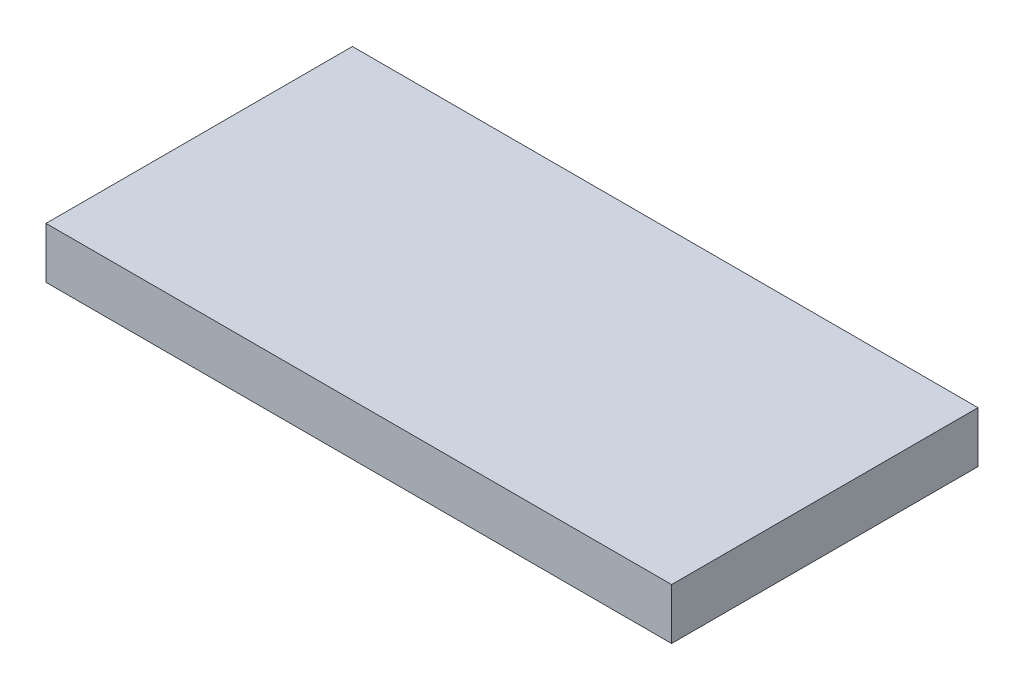
ISO-10303-21;
HEADER;
FILE_DESCRIPTION(('STEP AP214'),'2;1');
FILE_NAME('part.step','',(''),(''),'','','');
FILE_SCHEMA(('AUTOMOTIVE_DESIGN { 1 0 10303 214 1 1 1 1 }'));
ENDSEC;
DATA;
#1=APPLICATION_CONTEXT('core data for automotive mechanical design processes');
#2=APPLICATION_PROTOCOL_DEFINITION('international standard','automotive_design',2000,#1);
#3=PRODUCT_CONTEXT('',#1,'mechanical');
#4=PRODUCT('Part','Part','',(#3));
#5=PRODUCT_RELATED_PRODUCT_CATEGORY('part','',(#4));
#6=PRODUCT_DEFINITION_FORMATION('','',#4);
#7=PRODUCT_DEFINITION_CONTEXT('part definition',#1,'design');
#8=PRODUCT_DEFINITION('design','',#6,#7);
#9=PRODUCT_DEFINITION_SHAPE('','',#8);
#10=(LENGTH_UNIT() NAMED_UNIT(*) SI_UNIT(.MILLI.,.METRE.));
#11=(NAMED_UNIT(*) PLANE_ANGLE_UNIT() SI_UNIT($,.RADIAN.));
#12=(NAMED_UNIT(*) SI_UNIT($,.STERADIAN.) SOLID_ANGLE_UNIT());
#13=UNCERTAINTY_MEASURE_WITH_UNIT(LENGTH_MEASURE(1.E-05),#10,'distance_accuracy_value','');
#14=(GEOMETRIC_REPRESENTATION_CONTEXT(3) GLOBAL_UNCERTAINTY_ASSIGNED_CONTEXT((#13)) GLOBAL_UNIT_ASSIGNED_CONTEXT((#10,
#11,#12)) REPRESENTATION_CONTEXT('',''));
#15=CARTESIAN_POINT('',(0.,0.,0.));
#16=DIRECTION('',(0.,0.,1.));
#17=DIRECTION('',(1.,0.,0.));
#18=AXIS2_PLACEMENT_3D('',#15,#16,#17);
#19=CARTESIAN_POINT('',(49.,8.,24.));
#20=DIRECTION('',(-1.,0.,0.));
#21=DIRECTION('',(0.,0.,1.));
#22=AXIS2_PLACEMENT_3D('',#19,#20,#21);
#23=PLANE('',#22);
#24=DIRECTION('',(0.,0.,-1.));
#25=VECTOR('',#24,1.);
#26=CARTESIAN_POINT('',(49.,0.,24.));
#27=LINE('',#26,#25);
#28=CARTESIAN_POINT('',(49.,0.,24.));
#29=VERTEX_POINT('',#28);
#30=CARTESIAN_POINT('',(49.,0.,-24.));
#31=VERTEX_POINT('',#30);
#32=EDGE_CURVE('E96',#29,#31,#27,.T.);
#33=ORIENTED_EDGE('',*,*,#32,.T.);
#34=DIRECTION('',(0.,-1.,0.));
#35=VECTOR('',#34,1.);
#36=CARTESIAN_POINT('',(49.,8.,-24.));
#37=LINE('',#36,#35);
#38=CARTESIAN_POINT('',(49.,8.,-24.));
#39=VERTEX_POINT('',#38);
#40=EDGE_CURVE('E11',#39,#31,#37,.T.);
#41=ORIENTED_EDGE('',*,*,#40,.F.);
#42=DIRECTION('',(0.,0.,-1.));
#43=VECTOR('',#42,1.);
#44=CARTESIAN_POINT('',(49.,8.,24.));
#45=LINE('',#44,#43);
#46=CARTESIAN_POINT('',(49.,8.,24.));
#47=VERTEX_POINT('',#46);
#48=EDGE_CURVE('E84',#47,#39,#45,.T.);
#49=ORIENTED_EDGE('',*,*,#48,.F.);
#50=DIRECTION('',(0.,-1.,0.));
#51=VECTOR('',#50,1.);
#52=CARTESIAN_POINT('',(49.,8.,24.));
#53=LINE('',#52,#51);
#54=EDGE_CURVE('E92',#47,#29,#53,.T.);
#55=ORIENTED_EDGE('',*,*,#54,.T.);
#56=EDGE_LOOP('',(#33,#41,#49,#55));
#57=FACE_BOUND('',#56,.T.);
#58=ADVANCED_FACE('F33',(#57),#23,.F.);
#59=CARTESIAN_POINT('',(-49.,8.,-24.));
#60=DIRECTION('',(0.,0.,1.));
#61=DIRECTION('',(1.,0.,0.));
#62=AXIS2_PLACEMENT_3D('',#59,#60,#61);
#63=PLANE('',#62);
#64=DIRECTION('',(-1.,0.,0.));
#65=VECTOR('',#64,1.);
#66=CARTESIAN_POINT('',(-49.,0.,-24.));
#67=LINE('',#66,#65);
#68=CARTESIAN_POINT('',(-49.,0.,-24.));
#69=VERTEX_POINT('',#68);
#70=EDGE_CURVE('E88',#31,#69,#67,.T.);
#71=ORIENTED_EDGE('',*,*,#70,.T.);
#72=DIRECTION('',(0.,-1.,0.));
#73=VECTOR('',#72,1.);
#74=CARTESIAN_POINT('',(-49.,8.,-24.));
#75=LINE('',#74,#73);
#76=CARTESIAN_POINT('',(-49.,8.,-24.));
#77=VERTEX_POINT('',#76);
#78=EDGE_CURVE('E41',#77,#69,#75,.T.);
#79=ORIENTED_EDGE('',*,*,#78,.F.);
#80=DIRECTION('',(-1.,0.,0.));
#81=VECTOR('',#80,1.);
#82=CARTESIAN_POINT('',(-49.,8.,-24.));
#83=LINE('',#82,#81);
#84=EDGE_CURVE('E79',#39,#77,#83,.T.);
#85=ORIENTED_EDGE('',*,*,#84,.F.);
#86=ORIENTED_EDGE('',*,*,#40,.T.);
#87=EDGE_LOOP('',(#71,#79,#85,#86));
#88=FACE_BOUND('',#87,.T.);
#89=ADVANCED_FACE('F87',(#88),#63,.F.);
#90=CARTESIAN_POINT('',(-49.,8.,24.));
#91=DIRECTION('',(1.,0.,0.));
#92=DIRECTION('',(0.,0.,-1.));
#93=AXIS2_PLACEMENT_3D('',#90,#91,#92);
#94=PLANE('',#93);
#95=DIRECTION('',(0.,0.,1.));
#96=VECTOR('',#95,1.);
#97=CARTESIAN_POINT('',(-49.,0.,24.));
#98=LINE('',#97,#96);
#99=CARTESIAN_POINT('',(-49.,0.,24.));
#100=VERTEX_POINT('',#99);
#101=EDGE_CURVE('E66',#69,#100,#98,.T.);
#102=ORIENTED_EDGE('',*,*,#101,.T.);
#103=DIRECTION('',(0.,-1.,0.));
#104=VECTOR('',#103,1.);
#105=CARTESIAN_POINT('',(-49.,8.,24.));
#106=LINE('',#105,#104);
#107=CARTESIAN_POINT('',(-49.,8.,24.));
#108=VERTEX_POINT('',#107);
#109=EDGE_CURVE('E89',#108,#100,#106,.T.);
#110=ORIENTED_EDGE('',*,*,#109,.F.);
#111=DIRECTION('',(0.,0.,1.));
#112=VECTOR('',#111,1.);
#113=CARTESIAN_POINT('',(-49.,8.,24.));
#114=LINE('',#113,#112);
#115=EDGE_CURVE('E82',#77,#108,#114,.T.);
#116=ORIENTED_EDGE('',*,*,#115,.F.);
#117=ORIENTED_EDGE('',*,*,#78,.T.);
#118=EDGE_LOOP('',(#102,#110,#116,#117));
#119=FACE_BOUND('',#118,.T.);
#120=ADVANCED_FACE('F90',(#119),#94,.F.);
#121=CARTESIAN_POINT('',(-49.,8.,24.));
#122=DIRECTION('',(0.,0.,-1.));
#123=DIRECTION('',(-1.,0.,0.));
#124=AXIS2_PLACEMENT_3D('',#121,#122,#123);
#125=PLANE('',#124);
#126=DIRECTION('',(1.,0.,0.));
#127=VECTOR('',#126,1.);
#128=CARTESIAN_POINT('',(-49.,0.,24.));
#129=LINE('',#128,#127);
#130=EDGE_CURVE('E72',#100,#29,#129,.T.);
#131=ORIENTED_EDGE('',*,*,#130,.T.);
#132=ORIENTED_EDGE('',*,*,#54,.F.);
#133=DIRECTION('',(1.,0.,0.));
#134=VECTOR('',#133,1.);
#135=CARTESIAN_POINT('',(-49.,8.,24.));
#136=LINE('',#135,#134);
#137=EDGE_CURVE('E49',#108,#47,#136,.T.);
#138=ORIENTED_EDGE('',*,*,#137,.F.);
#139=ORIENTED_EDGE('',*,*,#109,.T.);
#140=EDGE_LOOP('',(#131,#132,#138,#139));
#141=FACE_BOUND('',#140,.T.);
#142=ADVANCED_FACE('F103',(#141),#125,.F.);
#143=CARTESIAN_POINT('',(0.,8.,0.));
#144=DIRECTION('',(0.,-1.,0.));
#145=DIRECTION('',(0.,0.,-1.));
#146=AXIS2_PLACEMENT_3D('',#143,#144,#145);
#147=PLANE('',#146);
#148=ORIENTED_EDGE('',*,*,#48,.T.);
#149=ORIENTED_EDGE('',*,*,#84,.T.);
#150=ORIENTED_EDGE('',*,*,#115,.T.);
#151=ORIENTED_EDGE('',*,*,#137,.T.);
#152=EDGE_LOOP('',(#148,#149,#150,#151));
#153=FACE_BOUND('',#152,.T.);
#154=ADVANCED_FACE('F80',(#153),#147,.F.);
#155=CARTESIAN_POINT('',(0.,0.,0.));
#156=DIRECTION('',(0.,-1.,0.));
#157=DIRECTION('',(0.,0.,-1.));
#158=AXIS2_PLACEMENT_3D('',#155,#156,#157);
#159=PLANE('',#158);
#160=ORIENTED_EDGE('',*,*,#32,.F.);
#161=ORIENTED_EDGE('',*,*,#130,.F.);
#162=ORIENTED_EDGE('',*,*,#101,.F.);
#163=ORIENTED_EDGE('',*,*,#70,.F.);
#164=EDGE_LOOP('',(#160,#161,#162,#163));
#165=FACE_BOUND('',#164,.T.);
#166=ADVANCED_FACE('F106',(#165),#159,.T.);
#167=CLOSED_SHELL('',(#58,#89,#120,#142,#154,#166));
#168=MANIFOLD_SOLID_BREP('B2',#167);
#169=ADVANCED_BREP_SHAPE_REPRESENTATION('',(#18,#168),#14);
#170=SHAPE_DEFINITION_REPRESENTATION(#9,#169);
ENDSEC;
END-ISO-10303-21;
